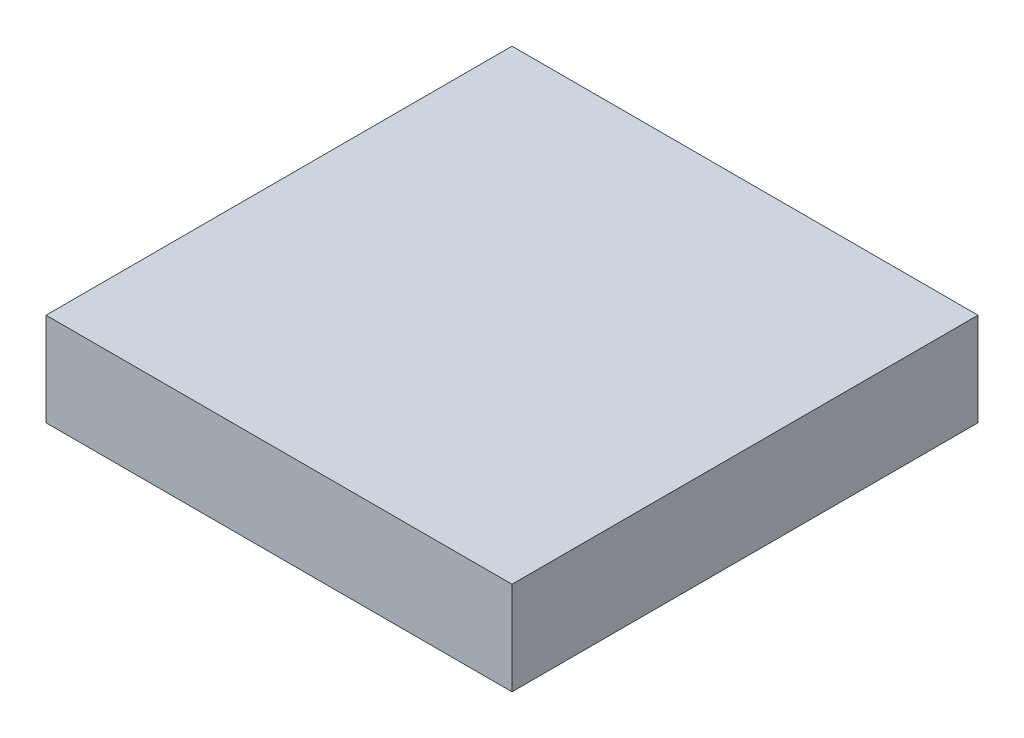
ISO-10303-21;
HEADER;
FILE_DESCRIPTION(('STEP AP214'),'2;1');
FILE_NAME('part.step','',(''),(''),'','','');
FILE_SCHEMA(('AUTOMOTIVE_DESIGN { 1 0 10303 214 1 1 1 1 }'));
ENDSEC;
DATA;
#1=APPLICATION_CONTEXT('core data for automotive mechanical design processes');
#2=APPLICATION_PROTOCOL_DEFINITION('international standard','automotive_design',2000,#1);
#3=PRODUCT_CONTEXT('',#1,'mechanical');
#4=PRODUCT('Part','Part','',(#3));
#5=PRODUCT_RELATED_PRODUCT_CATEGORY('part','',(#4));
#6=PRODUCT_DEFINITION_FORMATION('','',#4);
#7=PRODUCT_DEFINITION_CONTEXT('part definition',#1,'design');
#8=PRODUCT_DEFINITION('design','',#6,#7);
#9=PRODUCT_DEFINITION_SHAPE('','',#8);
#10=(LENGTH_UNIT() NAMED_UNIT(*) SI_UNIT(.MILLI.,.METRE.));
#11=(NAMED_UNIT(*) PLANE_ANGLE_UNIT() SI_UNIT($,.RADIAN.));
#12=(NAMED_UNIT(*) SI_UNIT($,.STERADIAN.) SOLID_ANGLE_UNIT());
#13=UNCERTAINTY_MEASURE_WITH_UNIT(LENGTH_MEASURE(1.E-05),#10,'distance_accuracy_value','');
#14=(GEOMETRIC_REPRESENTATION_CONTEXT(3) GLOBAL_UNCERTAINTY_ASSIGNED_CONTEXT((#13)) GLOBAL_UNIT_ASSIGNED_CONTEXT((#10,
#11,#12)) REPRESENTATION_CONTEXT('',''));
#15=CARTESIAN_POINT('',(0.,0.,0.));
#16=DIRECTION('',(0.,0.,1.));
#17=DIRECTION('',(1.,0.,0.));
#18=AXIS2_PLACEMENT_3D('',#15,#16,#17);
#19=CARTESIAN_POINT('',(-63.5,25.4,-63.5));
#20=DIRECTION('',(1.,0.,0.));
#21=DIRECTION('',(0.,0.,-1.));
#22=AXIS2_PLACEMENT_3D('',#19,#20,#21);
#23=PLANE('',#22);
#24=DIRECTION('',(0.,0.,1.));
#25=VECTOR('',#24,1.);
#26=CARTESIAN_POINT('',(-63.5,0.,-63.5));
#27=LINE('',#26,#25);
#28=CARTESIAN_POINT('',(-63.5,0.,-63.5));
#29=VERTEX_POINT('',#28);
#30=CARTESIAN_POINT('',(-63.5,0.,63.5));
#31=VERTEX_POINT('',#30);
#32=EDGE_CURVE('E96',#29,#31,#27,.T.);
#33=ORIENTED_EDGE('',*,*,#32,.T.);
#34=DIRECTION('',(0.,-1.,0.));
#35=VECTOR('',#34,1.);
#36=CARTESIAN_POINT('',(-63.5,25.4,63.5));
#37=LINE('',#36,#35);
#38=CARTESIAN_POINT('',(-63.5,25.4,63.5));
#39=VERTEX_POINT('',#38);
#40=EDGE_CURVE('E11',#39,#31,#37,.T.);
#41=ORIENTED_EDGE('',*,*,#40,.F.);
#42=DIRECTION('',(0.,0.,1.));
#43=VECTOR('',#42,1.);
#44=CARTESIAN_POINT('',(-63.5,25.4,-63.5));
#45=LINE('',#44,#43);
#46=CARTESIAN_POINT('',(-63.5,25.4,-63.5));
#47=VERTEX_POINT('',#46);
#48=EDGE_CURVE('E84',#47,#39,#45,.T.);
#49=ORIENTED_EDGE('',*,*,#48,.F.);
#50=DIRECTION('',(0.,-1.,0.));
#51=VECTOR('',#50,1.);
#52=CARTESIAN_POINT('',(-63.5,25.4,-63.5));
#53=LINE('',#52,#51);
#54=EDGE_CURVE('E92',#47,#29,#53,.T.);
#55=ORIENTED_EDGE('',*,*,#54,.T.);
#56=EDGE_LOOP('',(#33,#41,#49,#55));
#57=FACE_BOUND('',#56,.T.);
#58=ADVANCED_FACE('F33',(#57),#23,.F.);
#59=CARTESIAN_POINT('',(63.5,25.4,63.5));
#60=DIRECTION('',(0.,0.,-1.));
#61=DIRECTION('',(-1.,0.,0.));
#62=AXIS2_PLACEMENT_3D('',#59,#60,#61);
#63=PLANE('',#62);
#64=DIRECTION('',(1.,0.,0.));
#65=VECTOR('',#64,1.);
#66=CARTESIAN_POINT('',(63.5,0.,63.5));
#67=LINE('',#66,#65);
#68=CARTESIAN_POINT('',(63.5,0.,63.5));
#69=VERTEX_POINT('',#68);
#70=EDGE_CURVE('E88',#31,#69,#67,.T.);
#71=ORIENTED_EDGE('',*,*,#70,.T.);
#72=DIRECTION('',(0.,-1.,0.));
#73=VECTOR('',#72,1.);
#74=CARTESIAN_POINT('',(63.5,25.4,63.5));
#75=LINE('',#74,#73);
#76=CARTESIAN_POINT('',(63.5,25.4,63.5));
#77=VERTEX_POINT('',#76);
#78=EDGE_CURVE('E41',#77,#69,#75,.T.);
#79=ORIENTED_EDGE('',*,*,#78,.F.);
#80=DIRECTION('',(1.,0.,0.));
#81=VECTOR('',#80,1.);
#82=CARTESIAN_POINT('',(63.5,25.4,63.5));
#83=LINE('',#82,#81);
#84=EDGE_CURVE('E79',#39,#77,#83,.T.);
#85=ORIENTED_EDGE('',*,*,#84,.F.);
#86=ORIENTED_EDGE('',*,*,#40,.T.);
#87=EDGE_LOOP('',(#71,#79,#85,#86));
#88=FACE_BOUND('',#87,.T.);
#89=ADVANCED_FACE('F87',(#88),#63,.F.);
#90=CARTESIAN_POINT('',(63.5,25.4,-63.5));
#91=DIRECTION('',(-1.,0.,0.));
#92=DIRECTION('',(0.,0.,1.));
#93=AXIS2_PLACEMENT_3D('',#90,#91,#92);
#94=PLANE('',#93);
#95=DIRECTION('',(0.,0.,-1.));
#96=VECTOR('',#95,1.);
#97=CARTESIAN_POINT('',(63.5,0.,-63.5));
#98=LINE('',#97,#96);
#99=CARTESIAN_POINT('',(63.5,0.,-63.5));
#100=VERTEX_POINT('',#99);
#101=EDGE_CURVE('E66',#69,#100,#98,.T.);
#102=ORIENTED_EDGE('',*,*,#101,.T.);
#103=DIRECTION('',(0.,-1.,0.));
#104=VECTOR('',#103,1.);
#105=CARTESIAN_POINT('',(63.5,25.4,-63.5));
#106=LINE('',#105,#104);
#107=CARTESIAN_POINT('',(63.5,25.4,-63.5));
#108=VERTEX_POINT('',#107);
#109=EDGE_CURVE('E89',#108,#100,#106,.T.);
#110=ORIENTED_EDGE('',*,*,#109,.F.);
#111=DIRECTION('',(0.,0.,-1.));
#112=VECTOR('',#111,1.);
#113=CARTESIAN_POINT('',(63.5,25.4,-63.5));
#114=LINE('',#113,#112);
#115=EDGE_CURVE('E82',#77,#108,#114,.T.);
#116=ORIENTED_EDGE('',*,*,#115,.F.);
#117=ORIENTED_EDGE('',*,*,#78,.T.);
#118=EDGE_LOOP('',(#102,#110,#116,#117));
#119=FACE_BOUND('',#118,.T.);
#120=ADVANCED_FACE('F90',(#119),#94,.F.);
#121=CARTESIAN_POINT('',(63.5,25.4,-63.5));
#122=DIRECTION('',(0.,0.,1.));
#123=DIRECTION('',(1.,0.,0.));
#124=AXIS2_PLACEMENT_3D('',#121,#122,#123);
#125=PLANE('',#124);
#126=DIRECTION('',(-1.,0.,0.));
#127=VECTOR('',#126,1.);
#128=CARTESIAN_POINT('',(63.5,0.,-63.5));
#129=LINE('',#128,#127);
#130=EDGE_CURVE('E72',#100,#29,#129,.T.);
#131=ORIENTED_EDGE('',*,*,#130,.T.);
#132=ORIENTED_EDGE('',*,*,#54,.F.);
#133=DIRECTION('',(-1.,0.,0.));
#134=VECTOR('',#133,1.);
#135=CARTESIAN_POINT('',(63.5,25.4,-63.5));
#136=LINE('',#135,#134);
#137=EDGE_CURVE('E49',#108,#47,#136,.T.);
#138=ORIENTED_EDGE('',*,*,#137,.F.);
#139=ORIENTED_EDGE('',*,*,#109,.T.);
#140=EDGE_LOOP('',(#131,#132,#138,#139));
#141=FACE_BOUND('',#140,.T.);
#142=ADVANCED_FACE('F103',(#141),#125,.F.);
#143=CARTESIAN_POINT('',(0.,25.4,0.));
#144=DIRECTION('',(0.,-1.,0.));
#145=DIRECTION('',(0.,0.,-1.));
#146=AXIS2_PLACEMENT_3D('',#143,#144,#145);
#147=PLANE('',#146);
#148=ORIENTED_EDGE('',*,*,#48,.T.);
#149=ORIENTED_EDGE('',*,*,#84,.T.);
#150=ORIENTED_EDGE('',*,*,#115,.T.);
#151=ORIENTED_EDGE('',*,*,#137,.T.);
#152=EDGE_LOOP('',(#148,#149,#150,#151));
#153=FACE_BOUND('',#152,.T.);
#154=ADVANCED_FACE('F80',(#153),#147,.F.);
#155=CARTESIAN_POINT('',(0.,0.,0.));
#156=DIRECTION('',(0.,-1.,0.));
#157=DIRECTION('',(0.,0.,-1.));
#158=AXIS2_PLACEMENT_3D('',#155,#156,#157);
#159=PLANE('',#158);
#160=ORIENTED_EDGE('',*,*,#32,.F.);
#161=ORIENTED_EDGE('',*,*,#130,.F.);
#162=ORIENTED_EDGE('',*,*,#101,.F.);
#163=ORIENTED_EDGE('',*,*,#70,.F.);
#164=EDGE_LOOP('',(#160,#161,#162,#163));
#165=FACE_BOUND('',#164,.T.);
#166=ADVANCED_FACE('F106',(#165),#159,.T.);
#167=CLOSED_SHELL('',(#58,#89,#120,#142,#154,#166));
#168=MANIFOLD_SOLID_BREP('B2',#167);
#169=ADVANCED_BREP_SHAPE_REPRESENTATION('',(#18,#168),#14);
#170=SHAPE_DEFINITION_REPRESENTATION(#9,#169);
ENDSEC;
END-ISO-10303-21;
